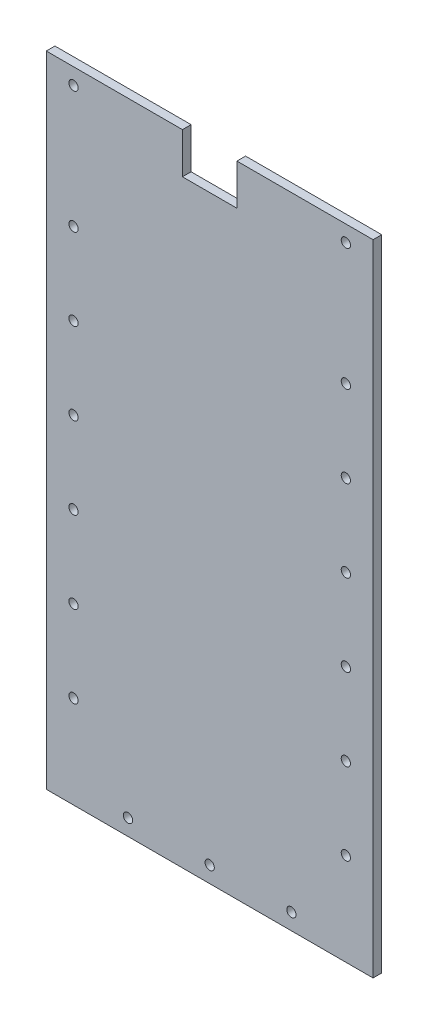
ISO-10303-21;
HEADER;
FILE_DESCRIPTION(('STEP AP214'),'2;1');
FILE_NAME('part.step','',(''),(''),'','','');
FILE_SCHEMA(('AUTOMOTIVE_DESIGN { 1 0 10303 214 1 1 1 1 }'));
ENDSEC;
DATA;
#1=APPLICATION_CONTEXT('core data for automotive mechanical design processes');
#2=APPLICATION_PROTOCOL_DEFINITION('international standard','automotive_design',2000,#1);
#3=PRODUCT_CONTEXT('',#1,'mechanical');
#4=PRODUCT('Part','Part','',(#3));
#5=PRODUCT_RELATED_PRODUCT_CATEGORY('part','',(#4));
#6=PRODUCT_DEFINITION_FORMATION('','',#4);
#7=PRODUCT_DEFINITION_CONTEXT('part definition',#1,'design');
#8=PRODUCT_DEFINITION('design','',#6,#7);
#9=PRODUCT_DEFINITION_SHAPE('','',#8);
#10=(LENGTH_UNIT() NAMED_UNIT(*) SI_UNIT(.MILLI.,.METRE.));
#11=(NAMED_UNIT(*) PLANE_ANGLE_UNIT() SI_UNIT($,.RADIAN.));
#12=(NAMED_UNIT(*) SI_UNIT($,.STERADIAN.) SOLID_ANGLE_UNIT());
#13=UNCERTAINTY_MEASURE_WITH_UNIT(LENGTH_MEASURE(1.E-05),#10,'distance_accuracy_value','');
#14=(GEOMETRIC_REPRESENTATION_CONTEXT(3) GLOBAL_UNCERTAINTY_ASSIGNED_CONTEXT((#13)) GLOBAL_UNIT_ASSIGNED_CONTEXT((#10,
#11,#12)) REPRESENTATION_CONTEXT('',''));
#15=CARTESIAN_POINT('',(0.,0.,0.));
#16=DIRECTION('',(0.,0.,1.));
#17=DIRECTION('',(1.,0.,0.));
#18=AXIS2_PLACEMENT_3D('',#15,#16,#17);
#19=CARTESIAN_POINT('',(0.,234.78,3.175));
#20=DIRECTION('',(0.,1.,0.));
#21=DIRECTION('',(0.,0.,1.));
#22=AXIS2_PLACEMENT_3D('',#19,#20,#21);
#23=PLANE('',#22);
#24=DIRECTION('',(0.,0.,1.));
#25=VECTOR('',#24,1.);
#26=CARTESIAN_POINT('',(70.,234.78,-0.00100000000000013));
#27=LINE('',#26,#25);
#28=CARTESIAN_POINT('',(70.,234.78,0.));
#29=VERTEX_POINT('',#28);
#30=CARTESIAN_POINT('',(70.,234.78,3.175));
#31=VERTEX_POINT('',#30);
#32=EDGE_CURVE('E110',#29,#31,#27,.T.);
#33=ORIENTED_EDGE('',*,*,#32,.T.);
#34=DIRECTION('',(1.,0.,0.));
#35=VECTOR('',#34,1.);
#36=CARTESIAN_POINT('',(0.,234.78,3.175));
#37=LINE('',#36,#35);
#38=CARTESIAN_POINT('',(120.,234.78,3.175));
#39=VERTEX_POINT('',#38);
#40=EDGE_CURVE('E264',#31,#39,#37,.T.);
#41=ORIENTED_EDGE('',*,*,#40,.T.);
#42=DIRECTION('',(0.,0.,-1.));
#43=VECTOR('',#42,1.);
#44=CARTESIAN_POINT('',(120.,234.78,3.175));
#45=LINE('',#44,#43);
#46=CARTESIAN_POINT('',(120.,234.78,0.));
#47=VERTEX_POINT('',#46);
#48=EDGE_CURVE('E43',#39,#47,#45,.T.);
#49=ORIENTED_EDGE('',*,*,#48,.T.);
#50=DIRECTION('',(1.,0.,0.));
#51=VECTOR('',#50,1.);
#52=CARTESIAN_POINT('',(0.,234.78,0.));
#53=LINE('',#52,#51);
#54=EDGE_CURVE('E124',#29,#47,#53,.T.);
#55=ORIENTED_EDGE('',*,*,#54,.F.);
#56=EDGE_LOOP('',(#33,#41,#49,#55));
#57=FACE_BOUND('',#56,.T.);
#58=ADVANCED_FACE('F34',(#57),#23,.T.);
#59=CARTESIAN_POINT('',(0.,0.,3.175));
#60=DIRECTION('',(0.,1.,0.));
#61=DIRECTION('',(0.,0.,1.));
#62=AXIS2_PLACEMENT_3D('',#59,#60,#61);
#63=PLANE('',#62);
#64=DIRECTION('',(1.,0.,0.));
#65=VECTOR('',#64,1.);
#66=CARTESIAN_POINT('',(0.,0.,0.));
#67=LINE('',#66,#65);
#68=CARTESIAN_POINT('',(0.,0.,0.));
#69=VERTEX_POINT('',#68);
#70=CARTESIAN_POINT('',(120.,0.,0.));
#71=VERTEX_POINT('',#70);
#72=EDGE_CURVE('E134',#69,#71,#67,.T.);
#73=ORIENTED_EDGE('',*,*,#72,.T.);
#74=DIRECTION('',(0.,0.,-1.));
#75=VECTOR('',#74,1.);
#76=CARTESIAN_POINT('',(120.,0.,3.175));
#77=LINE('',#76,#75);
#78=CARTESIAN_POINT('',(120.,0.,3.175));
#79=VERTEX_POINT('',#78);
#80=EDGE_CURVE('E11',#79,#71,#77,.T.);
#81=ORIENTED_EDGE('',*,*,#80,.F.);
#82=DIRECTION('',(1.,0.,0.));
#83=VECTOR('',#82,1.);
#84=CARTESIAN_POINT('',(0.,0.,3.175));
#85=LINE('',#84,#83);
#86=CARTESIAN_POINT('',(0.,0.,3.175));
#87=VERTEX_POINT('',#86);
#88=EDGE_CURVE('E140',#87,#79,#85,.T.);
#89=ORIENTED_EDGE('',*,*,#88,.F.);
#90=DIRECTION('',(0.,0.,-1.));
#91=VECTOR('',#90,1.);
#92=CARTESIAN_POINT('',(0.,0.,3.175));
#93=LINE('',#92,#91);
#94=EDGE_CURVE('E60',#87,#69,#93,.T.);
#95=ORIENTED_EDGE('',*,*,#94,.T.);
#96=EDGE_LOOP('',(#73,#81,#89,#95));
#97=FACE_BOUND('',#96,.T.);
#98=ADVANCED_FACE('F36',(#97),#63,.F.);
#99=CARTESIAN_POINT('',(120.,0.,3.175));
#100=DIRECTION('',(-1.,0.,0.));
#101=DIRECTION('',(0.,0.,1.));
#102=AXIS2_PLACEMENT_3D('',#99,#100,#101);
#103=PLANE('',#102);
#104=DIRECTION('',(0.,1.,0.));
#105=VECTOR('',#104,1.);
#106=CARTESIAN_POINT('',(120.,0.,0.));
#107=LINE('',#106,#105);
#108=EDGE_CURVE('E130',#71,#47,#107,.T.);
#109=ORIENTED_EDGE('',*,*,#108,.T.);
#110=ORIENTED_EDGE('',*,*,#48,.F.);
#111=DIRECTION('',(0.,1.,0.));
#112=VECTOR('',#111,1.);
#113=CARTESIAN_POINT('',(120.,0.,3.175));
#114=LINE('',#113,#112);
#115=EDGE_CURVE('E86',#79,#39,#114,.T.);
#116=ORIENTED_EDGE('',*,*,#115,.F.);
#117=ORIENTED_EDGE('',*,*,#80,.T.);
#118=EDGE_LOOP('',(#109,#110,#116,#117));
#119=FACE_BOUND('',#118,.T.);
#120=ADVANCED_FACE('F283',(#119),#103,.F.);
#121=DIRECTION('',(0.,0.,1.));
#122=VECTOR('',#121,1.);
#123=CARTESIAN_POINT('',(50.,234.78,-0.00100000000000013));
#124=LINE('',#123,#122);
#125=CARTESIAN_POINT('',(50.,234.78,0.));
#126=VERTEX_POINT('',#125);
#127=CARTESIAN_POINT('',(50.,234.78,3.175));
#128=VERTEX_POINT('',#127);
#129=EDGE_CURVE('E119',#126,#128,#124,.T.);
#130=ORIENTED_EDGE('',*,*,#129,.F.);
#131=CARTESIAN_POINT('',(0.,234.78,0.));
#132=VERTEX_POINT('',#131);
#133=EDGE_CURVE('E129',#132,#126,#53,.T.);
#134=ORIENTED_EDGE('',*,*,#133,.F.);
#135=DIRECTION('',(0.,0.,-1.));
#136=VECTOR('',#135,1.);
#137=CARTESIAN_POINT('',(0.,234.78,3.175));
#138=LINE('',#137,#136);
#139=CARTESIAN_POINT('',(0.,234.78,3.175));
#140=VERTEX_POINT('',#139);
#141=EDGE_CURVE('E142',#140,#132,#138,.T.);
#142=ORIENTED_EDGE('',*,*,#141,.F.);
#143=EDGE_CURVE('E265',#140,#128,#37,.T.);
#144=ORIENTED_EDGE('',*,*,#143,.T.);
#145=EDGE_LOOP('',(#130,#134,#142,#144));
#146=FACE_BOUND('',#145,.T.);
#147=ADVANCED_FACE('F275',(#146),#23,.T.);
#148=CARTESIAN_POINT('',(0.,0.,3.175));
#149=DIRECTION('',(-1.,0.,0.));
#150=DIRECTION('',(0.,0.,1.));
#151=AXIS2_PLACEMENT_3D('',#148,#149,#150);
#152=PLANE('',#151);
#153=DIRECTION('',(0.,1.,0.));
#154=VECTOR('',#153,1.);
#155=CARTESIAN_POINT('',(0.,0.,0.));
#156=LINE('',#155,#154);
#157=EDGE_CURVE('E133',#69,#132,#156,.T.);
#158=ORIENTED_EDGE('',*,*,#157,.F.);
#159=ORIENTED_EDGE('',*,*,#94,.F.);
#160=DIRECTION('',(0.,1.,0.));
#161=VECTOR('',#160,1.);
#162=CARTESIAN_POINT('',(0.,0.,3.175));
#163=LINE('',#162,#161);
#164=EDGE_CURVE('E143',#87,#140,#163,.T.);
#165=ORIENTED_EDGE('',*,*,#164,.T.);
#166=ORIENTED_EDGE('',*,*,#141,.T.);
#167=EDGE_LOOP('',(#158,#159,#165,#166));
#168=FACE_BOUND('',#167,.T.);
#169=ADVANCED_FACE('F269',(#168),#152,.T.);
#170=CARTESIAN_POINT('',(0.,0.,3.175));
#171=DIRECTION('',(0.,0.,1.));
#172=DIRECTION('',(1.,0.,0.));
#173=AXIS2_PLACEMENT_3D('',#170,#171,#172);
#174=PLANE('',#173);
#175=CARTESIAN_POINT('',(10.0000000000027,228.834897948557,3.17499999999999));
#176=DIRECTION('',(0.,0.,1.));
#177=DIRECTION('',(1.,0.,0.));
#178=AXIS2_PLACEMENT_3D('',#175,#176,#177);
#179=CIRCLE('',#178,1.7);
#180=CARTESIAN_POINT('',(11.7000000000027,228.834897948557,3.17499999999999));
#181=VERTEX_POINT('',#180);
#182=EDGE_CURVE('E200',#181,#181,#179,.T.);
#183=ORIENTED_EDGE('',*,*,#182,.F.);
#184=EDGE_LOOP('',(#183));
#185=FACE_BOUND('',#184,.T.);
#186=CARTESIAN_POINT('',(10.0000000000054,184.000000000001,3.17499999999999));
#187=DIRECTION('',(0.,0.,1.));
#188=DIRECTION('',(1.,0.,0.));
#189=AXIS2_PLACEMENT_3D('',#186,#187,#188);
#190=CIRCLE('',#189,1.7);
#191=CARTESIAN_POINT('',(11.7000000000054,184.000000000001,3.17499999999999));
#192=VERTEX_POINT('',#191);
#193=EDGE_CURVE('E189',#192,#192,#190,.T.);
#194=ORIENTED_EDGE('',*,*,#193,.F.);
#195=EDGE_LOOP('',(#194));
#196=FACE_BOUND('',#195,.T.);
#197=CARTESIAN_POINT('',(10.0000000000052,124.000000000001,3.17499999999999));
#198=DIRECTION('',(0.,0.,1.));
#199=DIRECTION('',(1.,0.,0.));
#200=AXIS2_PLACEMENT_3D('',#197,#198,#199);
#201=CIRCLE('',#200,1.7);
#202=CARTESIAN_POINT('',(11.7000000000052,124.000000000001,3.17499999999999));
#203=VERTEX_POINT('',#202);
#204=EDGE_CURVE('E188',#203,#203,#201,.T.);
#205=ORIENTED_EDGE('',*,*,#204,.F.);
#206=EDGE_LOOP('',(#205));
#207=FACE_BOUND('',#206,.T.);
#208=CARTESIAN_POINT('',(10.0000000000051,94.0000000000007,3.17499999999999));
#209=DIRECTION('',(0.,0.,1.));
#210=DIRECTION('',(1.,0.,0.));
#211=AXIS2_PLACEMENT_3D('',#208,#209,#210);
#212=CIRCLE('',#211,1.7);
#213=CARTESIAN_POINT('',(11.7000000000051,94.0000000000007,3.17499999999999));
#214=VERTEX_POINT('',#213);
#215=EDGE_CURVE('E185',#214,#214,#212,.T.);
#216=ORIENTED_EDGE('',*,*,#215,.F.);
#217=EDGE_LOOP('',(#216));
#218=FACE_BOUND('',#217,.T.);
#219=CARTESIAN_POINT('',(10.0000000000049,64.0000000000007,3.17499999999999));
#220=DIRECTION('',(0.,0.,1.));
#221=DIRECTION('',(1.,0.,0.));
#222=AXIS2_PLACEMENT_3D('',#219,#220,#221);
#223=CIRCLE('',#222,1.7);
#224=CARTESIAN_POINT('',(11.7000000000049,64.0000000000007,3.17499999999999));
#225=VERTEX_POINT('',#224);
#226=EDGE_CURVE('E182',#225,#225,#223,.T.);
#227=ORIENTED_EDGE('',*,*,#226,.F.);
#228=EDGE_LOOP('',(#227));
#229=FACE_BOUND('',#228,.T.);
#230=CARTESIAN_POINT('',(10.0000000000048,34.0000000000007,3.17499999999999));
#231=DIRECTION('',(0.,0.,1.));
#232=DIRECTION('',(1.,0.,0.));
#233=AXIS2_PLACEMENT_3D('',#230,#231,#232);
#234=CIRCLE('',#233,1.7);
#235=CARTESIAN_POINT('',(11.7000000000048,34.0000000000007,3.17499999999999));
#236=VERTEX_POINT('',#235);
#237=EDGE_CURVE('E178',#236,#236,#234,.T.);
#238=ORIENTED_EDGE('',*,*,#237,.F.);
#239=EDGE_LOOP('',(#238));
#240=FACE_BOUND('',#239,.T.);
#241=CARTESIAN_POINT('',(110.000000000003,228.834897948556,3.17499999999999));
#242=DIRECTION('',(0.,0.,1.));
#243=DIRECTION('',(1.,0.,0.));
#244=AXIS2_PLACEMENT_3D('',#241,#242,#243);
#245=CIRCLE('',#244,1.69999999999999);
#246=CARTESIAN_POINT('',(111.700000000003,228.834897948556,3.17499999999999));
#247=VERTEX_POINT('',#246);
#248=EDGE_CURVE('E177',#247,#247,#245,.T.);
#249=ORIENTED_EDGE('',*,*,#248,.F.);
#250=EDGE_LOOP('',(#249));
#251=FACE_BOUND('',#250,.T.);
#252=CARTESIAN_POINT('',(10.0000000000053,154.000000000001,3.17499999999999));
#253=DIRECTION('',(0.,0.,1.));
#254=DIRECTION('',(1.,0.,0.));
#255=AXIS2_PLACEMENT_3D('',#252,#253,#254);
#256=CIRCLE('',#255,1.7);
#257=CARTESIAN_POINT('',(11.7000000000053,154.000000000001,3.17499999999999));
#258=VERTEX_POINT('',#257);
#259=EDGE_CURVE('E173',#258,#258,#256,.T.);
#260=ORIENTED_EDGE('',*,*,#259,.F.);
#261=EDGE_LOOP('',(#260));
#262=FACE_BOUND('',#261,.T.);
#263=CARTESIAN_POINT('',(29.9999999999996,5.94489794855652,3.17499999999999));
#264=DIRECTION('',(0.,0.,1.));
#265=DIRECTION('',(1.,0.,0.));
#266=AXIS2_PLACEMENT_3D('',#263,#264,#265);
#267=CIRCLE('',#266,1.7);
#268=CARTESIAN_POINT('',(31.6999999999996,5.94489794855652,3.17499999999999));
#269=VERTEX_POINT('',#268);
#270=EDGE_CURVE('E172',#269,#269,#267,.T.);
#271=ORIENTED_EDGE('',*,*,#270,.F.);
#272=EDGE_LOOP('',(#271));
#273=FACE_BOUND('',#272,.T.);
#274=CARTESIAN_POINT('',(59.9999999999996,5.9448979485561,3.17499999999999));
#275=DIRECTION('',(0.,0.,1.));
#276=DIRECTION('',(1.,0.,0.));
#277=AXIS2_PLACEMENT_3D('',#274,#275,#276);
#278=CIRCLE('',#277,1.7);
#279=CARTESIAN_POINT('',(61.6999999999996,5.9448979485561,3.17499999999999));
#280=VERTEX_POINT('',#279);
#281=EDGE_CURVE('E223',#280,#280,#278,.T.);
#282=ORIENTED_EDGE('',*,*,#281,.F.);
#283=EDGE_LOOP('',(#282));
#284=FACE_BOUND('',#283,.T.);
#285=CARTESIAN_POINT('',(89.9999999999996,5.94489794855568,3.17499999999999));
#286=DIRECTION('',(0.,0.,1.));
#287=DIRECTION('',(1.,0.,0.));
#288=AXIS2_PLACEMENT_3D('',#285,#286,#287);
#289=CIRCLE('',#288,1.69999999999999);
#290=CARTESIAN_POINT('',(91.6999999999996,5.94489794855568,3.17499999999999));
#291=VERTEX_POINT('',#290);
#292=EDGE_CURVE('E168',#291,#291,#289,.T.);
#293=ORIENTED_EDGE('',*,*,#292,.F.);
#294=EDGE_LOOP('',(#293));
#295=FACE_BOUND('',#294,.T.);
#296=CARTESIAN_POINT('',(110.000000000003,184.000000000001,3.17499999999999));
#297=DIRECTION('',(0.,0.,1.));
#298=DIRECTION('',(1.,0.,0.));
#299=AXIS2_PLACEMENT_3D('',#296,#297,#298);
#300=CIRCLE('',#299,1.69999999999999);
#301=CARTESIAN_POINT('',(111.700000000003,184.000000000001,3.17499999999999));
#302=VERTEX_POINT('',#301);
#303=EDGE_CURVE('E167',#302,#302,#300,.T.);
#304=ORIENTED_EDGE('',*,*,#303,.F.);
#305=EDGE_LOOP('',(#304));
#306=FACE_BOUND('',#305,.T.);
#307=CARTESIAN_POINT('',(110.000000000003,154.000000000001,3.17499999999999));
#308=DIRECTION('',(0.,0.,1.));
#309=DIRECTION('',(1.,0.,0.));
#310=AXIS2_PLACEMENT_3D('',#307,#308,#309);
#311=CIRCLE('',#310,1.69999999999999);
#312=CARTESIAN_POINT('',(111.700000000003,154.000000000001,3.17499999999999));
#313=VERTEX_POINT('',#312);
#314=EDGE_CURVE('E163',#313,#313,#311,.T.);
#315=ORIENTED_EDGE('',*,*,#314,.F.);
#316=EDGE_LOOP('',(#315));
#317=FACE_BOUND('',#316,.T.);
#318=CARTESIAN_POINT('',(110.000000000003,124.000000000001,3.17499999999999));
#319=DIRECTION('',(0.,0.,1.));
#320=DIRECTION('',(1.,0.,0.));
#321=AXIS2_PLACEMENT_3D('',#318,#319,#320);
#322=CIRCLE('',#321,1.69999999999999);
#323=CARTESIAN_POINT('',(111.700000000003,124.000000000001,3.17499999999999));
#324=VERTEX_POINT('',#323);
#325=EDGE_CURVE('E159',#324,#324,#322,.T.);
#326=ORIENTED_EDGE('',*,*,#325,.F.);
#327=EDGE_LOOP('',(#326));
#328=FACE_BOUND('',#327,.T.);
#329=CARTESIAN_POINT('',(110.000000000003,94.0000000000007,3.17499999999999));
#330=DIRECTION('',(0.,0.,1.));
#331=DIRECTION('',(1.,0.,0.));
#332=AXIS2_PLACEMENT_3D('',#329,#330,#331);
#333=CIRCLE('',#332,1.69999999999999);
#334=CARTESIAN_POINT('',(111.700000000003,94.0000000000007,3.17499999999999));
#335=VERTEX_POINT('',#334);
#336=EDGE_CURVE('E155',#335,#335,#333,.T.);
#337=ORIENTED_EDGE('',*,*,#336,.F.);
#338=EDGE_LOOP('',(#337));
#339=FACE_BOUND('',#338,.T.);
#340=CARTESIAN_POINT('',(110.000000000003,64.0000000000007,3.17499999999999));
#341=DIRECTION('',(0.,0.,1.));
#342=DIRECTION('',(1.,0.,0.));
#343=AXIS2_PLACEMENT_3D('',#340,#341,#342);
#344=CIRCLE('',#343,1.69999999999999);
#345=CARTESIAN_POINT('',(111.700000000003,64.0000000000007,3.17499999999999));
#346=VERTEX_POINT('',#345);
#347=EDGE_CURVE('E154',#346,#346,#344,.T.);
#348=ORIENTED_EDGE('',*,*,#347,.F.);
#349=EDGE_LOOP('',(#348));
#350=FACE_BOUND('',#349,.T.);
#351=CARTESIAN_POINT('',(110.000000000003,34.0000000000007,3.17499999999999));
#352=DIRECTION('',(0.,0.,1.));
#353=DIRECTION('',(1.,0.,0.));
#354=AXIS2_PLACEMENT_3D('',#351,#352,#353);
#355=CIRCLE('',#354,1.69999999999999);
#356=CARTESIAN_POINT('',(111.700000000003,34.0000000000007,3.17499999999999));
#357=VERTEX_POINT('',#356);
#358=EDGE_CURVE('E150',#357,#357,#355,.T.);
#359=ORIENTED_EDGE('',*,*,#358,.F.);
#360=EDGE_LOOP('',(#359));
#361=FACE_BOUND('',#360,.T.);
#362=DIRECTION('',(0.,1.,0.));
#363=VECTOR('',#362,1.);
#364=CARTESIAN_POINT('',(70.,219.78,3.175));
#365=LINE('',#364,#363);
#366=CARTESIAN_POINT('',(70.,219.78,3.175));
#367=VERTEX_POINT('',#366);
#368=EDGE_CURVE('E115',#367,#31,#365,.T.);
#369=ORIENTED_EDGE('',*,*,#368,.F.);
#370=DIRECTION('',(1.,0.,0.));
#371=VECTOR('',#370,1.);
#372=CARTESIAN_POINT('',(50.,219.78,3.175));
#373=LINE('',#372,#371);
#374=CARTESIAN_POINT('',(50.,219.78,3.175));
#375=VERTEX_POINT('',#374);
#376=EDGE_CURVE('E120',#375,#367,#373,.T.);
#377=ORIENTED_EDGE('',*,*,#376,.F.);
#378=DIRECTION('',(0.,-1.,0.));
#379=VECTOR('',#378,1.);
#380=CARTESIAN_POINT('',(50.,219.78,3.175));
#381=LINE('',#380,#379);
#382=EDGE_CURVE('E252',#128,#375,#381,.T.);
#383=ORIENTED_EDGE('',*,*,#382,.F.);
#384=ORIENTED_EDGE('',*,*,#143,.F.);
#385=ORIENTED_EDGE('',*,*,#164,.F.);
#386=ORIENTED_EDGE('',*,*,#88,.T.);
#387=ORIENTED_EDGE('',*,*,#115,.T.);
#388=ORIENTED_EDGE('',*,*,#40,.F.);
#389=EDGE_LOOP('',(#369,#377,#383,#384,#385,#386,#387,#388));
#390=FACE_BOUND('',#389,.T.);
#391=ADVANCED_FACE('F282',(#185,#196,#207,#218,#229,#240,#251,#262,#273,#284,#295,#306,#317,
#328,#339,#350,#361,#390),#174,.T.);
#392=CARTESIAN_POINT('',(0.,0.,0.));
#393=DIRECTION('',(0.,0.,1.));
#394=DIRECTION('',(1.,0.,0.));
#395=AXIS2_PLACEMENT_3D('',#392,#393,#394);
#396=PLANE('',#395);
#397=CARTESIAN_POINT('',(10.0000000000027,228.834897948557,0.));
#398=DIRECTION('',(0.,0.,1.));
#399=DIRECTION('',(1.,0.,0.));
#400=AXIS2_PLACEMENT_3D('',#397,#398,#399);
#401=CIRCLE('',#400,1.7);
#402=CARTESIAN_POINT('',(11.7000000000027,228.834897948557,0.));
#403=VERTEX_POINT('',#402);
#404=EDGE_CURVE('E38',#403,#403,#401,.T.);
#405=ORIENTED_EDGE('',*,*,#404,.T.);
#406=EDGE_LOOP('',(#405));
#407=FACE_BOUND('',#406,.T.);
#408=CARTESIAN_POINT('',(10.0000000000054,184.000000000001,0.));
#409=DIRECTION('',(0.,0.,1.));
#410=DIRECTION('',(1.,0.,0.));
#411=AXIS2_PLACEMENT_3D('',#408,#409,#410);
#412=CIRCLE('',#411,1.7);
#413=CARTESIAN_POINT('',(11.7000000000054,184.000000000001,0.));
#414=VERTEX_POINT('',#413);
#415=EDGE_CURVE('E186',#414,#414,#412,.T.);
#416=ORIENTED_EDGE('',*,*,#415,.T.);
#417=EDGE_LOOP('',(#416));
#418=FACE_BOUND('',#417,.T.);
#419=CARTESIAN_POINT('',(10.0000000000052,124.000000000001,0.));
#420=DIRECTION('',(0.,0.,1.));
#421=DIRECTION('',(1.,0.,0.));
#422=AXIS2_PLACEMENT_3D('',#419,#420,#421);
#423=CIRCLE('',#422,1.7);
#424=CARTESIAN_POINT('',(11.7000000000052,124.000000000001,0.));
#425=VERTEX_POINT('',#424);
#426=EDGE_CURVE('E193',#425,#425,#423,.T.);
#427=ORIENTED_EDGE('',*,*,#426,.T.);
#428=EDGE_LOOP('',(#427));
#429=FACE_BOUND('',#428,.T.);
#430=CARTESIAN_POINT('',(10.0000000000051,94.0000000000007,0.));
#431=DIRECTION('',(0.,0.,1.));
#432=DIRECTION('',(1.,0.,0.));
#433=AXIS2_PLACEMENT_3D('',#430,#431,#432);
#434=CIRCLE('',#433,1.7);
#435=CARTESIAN_POINT('',(11.7000000000051,94.0000000000007,0.));
#436=VERTEX_POINT('',#435);
#437=EDGE_CURVE('E183',#436,#436,#434,.T.);
#438=ORIENTED_EDGE('',*,*,#437,.T.);
#439=EDGE_LOOP('',(#438));
#440=FACE_BOUND('',#439,.T.);
#441=CARTESIAN_POINT('',(10.0000000000049,64.0000000000007,0.));
#442=DIRECTION('',(0.,0.,1.));
#443=DIRECTION('',(1.,0.,0.));
#444=AXIS2_PLACEMENT_3D('',#441,#442,#443);
#445=CIRCLE('',#444,1.7);
#446=CARTESIAN_POINT('',(11.7000000000049,64.0000000000007,0.));
#447=VERTEX_POINT('',#446);
#448=EDGE_CURVE('E179',#447,#447,#445,.T.);
#449=ORIENTED_EDGE('',*,*,#448,.T.);
#450=EDGE_LOOP('',(#449));
#451=FACE_BOUND('',#450,.T.);
#452=CARTESIAN_POINT('',(10.0000000000048,34.0000000000007,0.));
#453=DIRECTION('',(0.,0.,1.));
#454=DIRECTION('',(1.,0.,0.));
#455=AXIS2_PLACEMENT_3D('',#452,#453,#454);
#456=CIRCLE('',#455,1.7);
#457=CARTESIAN_POINT('',(11.7000000000048,34.0000000000007,0.));
#458=VERTEX_POINT('',#457);
#459=EDGE_CURVE('E174',#458,#458,#456,.T.);
#460=ORIENTED_EDGE('',*,*,#459,.T.);
#461=EDGE_LOOP('',(#460));
#462=FACE_BOUND('',#461,.T.);
#463=CARTESIAN_POINT('',(110.000000000003,228.834897948556,0.));
#464=DIRECTION('',(0.,0.,1.));
#465=DIRECTION('',(1.,0.,0.));
#466=AXIS2_PLACEMENT_3D('',#463,#464,#465);
#467=CIRCLE('',#466,1.69999999999999);
#468=CARTESIAN_POINT('',(111.700000000003,228.834897948556,0.));
#469=VERTEX_POINT('',#468);
#470=EDGE_CURVE('E213',#469,#469,#467,.T.);
#471=ORIENTED_EDGE('',*,*,#470,.T.);
#472=EDGE_LOOP('',(#471));
#473=FACE_BOUND('',#472,.T.);
#474=CARTESIAN_POINT('',(10.0000000000053,154.000000000001,0.));
#475=DIRECTION('',(0.,0.,1.));
#476=DIRECTION('',(1.,0.,0.));
#477=AXIS2_PLACEMENT_3D('',#474,#475,#476);
#478=CIRCLE('',#477,1.7);
#479=CARTESIAN_POINT('',(11.7000000000053,154.000000000001,0.));
#480=VERTEX_POINT('',#479);
#481=EDGE_CURVE('E169',#480,#480,#478,.T.);
#482=ORIENTED_EDGE('',*,*,#481,.T.);
#483=EDGE_LOOP('',(#482));
#484=FACE_BOUND('',#483,.T.);
#485=CARTESIAN_POINT('',(29.9999999999996,5.94489794855652,0.));
#486=DIRECTION('',(0.,0.,1.));
#487=DIRECTION('',(1.,0.,0.));
#488=AXIS2_PLACEMENT_3D('',#485,#486,#487);
#489=CIRCLE('',#488,1.7);
#490=CARTESIAN_POINT('',(31.6999999999996,5.94489794855652,0.));
#491=VERTEX_POINT('',#490);
#492=EDGE_CURVE('E220',#491,#491,#489,.T.);
#493=ORIENTED_EDGE('',*,*,#492,.T.);
#494=EDGE_LOOP('',(#493));
#495=FACE_BOUND('',#494,.T.);
#496=CARTESIAN_POINT('',(59.9999999999996,5.9448979485561,0.));
#497=DIRECTION('',(0.,0.,1.));
#498=DIRECTION('',(1.,0.,0.));
#499=AXIS2_PLACEMENT_3D('',#496,#497,#498);
#500=CIRCLE('',#499,1.7);
#501=CARTESIAN_POINT('',(61.6999999999996,5.9448979485561,0.));
#502=VERTEX_POINT('',#501);
#503=EDGE_CURVE('E226',#502,#502,#500,.T.);
#504=ORIENTED_EDGE('',*,*,#503,.T.);
#505=EDGE_LOOP('',(#504));
#506=FACE_BOUND('',#505,.T.);
#507=CARTESIAN_POINT('',(89.9999999999996,5.94489794855568,0.));
#508=DIRECTION('',(0.,0.,1.));
#509=DIRECTION('',(1.,0.,0.));
#510=AXIS2_PLACEMENT_3D('',#507,#508,#509);
#511=CIRCLE('',#510,1.69999999999999);
#512=CARTESIAN_POINT('',(91.6999999999996,5.94489794855568,0.));
#513=VERTEX_POINT('',#512);
#514=EDGE_CURVE('E164',#513,#513,#511,.T.);
#515=ORIENTED_EDGE('',*,*,#514,.T.);
#516=EDGE_LOOP('',(#515));
#517=FACE_BOUND('',#516,.T.);
#518=CARTESIAN_POINT('',(110.000000000003,184.000000000001,0.));
#519=DIRECTION('',(0.,0.,1.));
#520=DIRECTION('',(1.,0.,0.));
#521=AXIS2_PLACEMENT_3D('',#518,#519,#520);
#522=CIRCLE('',#521,1.69999999999999);
#523=CARTESIAN_POINT('',(111.700000000003,184.000000000001,0.));
#524=VERTEX_POINT('',#523);
#525=EDGE_CURVE('E233',#524,#524,#522,.T.);
#526=ORIENTED_EDGE('',*,*,#525,.T.);
#527=EDGE_LOOP('',(#526));
#528=FACE_BOUND('',#527,.T.);
#529=CARTESIAN_POINT('',(110.000000000003,154.000000000001,0.));
#530=DIRECTION('',(0.,0.,1.));
#531=DIRECTION('',(1.,0.,0.));
#532=AXIS2_PLACEMENT_3D('',#529,#530,#531);
#533=CIRCLE('',#532,1.69999999999999);
#534=CARTESIAN_POINT('',(111.700000000003,154.000000000001,0.));
#535=VERTEX_POINT('',#534);
#536=EDGE_CURVE('E160',#535,#535,#533,.T.);
#537=ORIENTED_EDGE('',*,*,#536,.T.);
#538=EDGE_LOOP('',(#537));
#539=FACE_BOUND('',#538,.T.);
#540=CARTESIAN_POINT('',(110.000000000003,124.000000000001,0.));
#541=DIRECTION('',(0.,0.,1.));
#542=DIRECTION('',(1.,0.,0.));
#543=AXIS2_PLACEMENT_3D('',#540,#541,#542);
#544=CIRCLE('',#543,1.69999999999999);
#545=CARTESIAN_POINT('',(111.700000000003,124.000000000001,0.));
#546=VERTEX_POINT('',#545);
#547=EDGE_CURVE('E156',#546,#546,#544,.T.);
#548=ORIENTED_EDGE('',*,*,#547,.T.);
#549=EDGE_LOOP('',(#548));
#550=FACE_BOUND('',#549,.T.);
#551=CARTESIAN_POINT('',(110.000000000003,94.0000000000007,0.));
#552=DIRECTION('',(0.,0.,1.));
#553=DIRECTION('',(1.,0.,0.));
#554=AXIS2_PLACEMENT_3D('',#551,#552,#553);
#555=CIRCLE('',#554,1.69999999999999);
#556=CARTESIAN_POINT('',(111.700000000003,94.0000000000007,0.));
#557=VERTEX_POINT('',#556);
#558=EDGE_CURVE('E151',#557,#557,#555,.T.);
#559=ORIENTED_EDGE('',*,*,#558,.T.);
#560=EDGE_LOOP('',(#559));
#561=FACE_BOUND('',#560,.T.);
#562=CARTESIAN_POINT('',(110.000000000003,64.0000000000007,0.));
#563=DIRECTION('',(0.,0.,1.));
#564=DIRECTION('',(1.,0.,0.));
#565=AXIS2_PLACEMENT_3D('',#562,#563,#564);
#566=CIRCLE('',#565,1.69999999999999);
#567=CARTESIAN_POINT('',(111.700000000003,64.0000000000007,0.));
#568=VERTEX_POINT('',#567);
#569=EDGE_CURVE('E244',#568,#568,#566,.T.);
#570=ORIENTED_EDGE('',*,*,#569,.T.);
#571=EDGE_LOOP('',(#570));
#572=FACE_BOUND('',#571,.T.);
#573=CARTESIAN_POINT('',(110.000000000003,34.0000000000007,0.));
#574=DIRECTION('',(0.,0.,1.));
#575=DIRECTION('',(1.,0.,0.));
#576=AXIS2_PLACEMENT_3D('',#573,#574,#575);
#577=CIRCLE('',#576,1.69999999999999);
#578=CARTESIAN_POINT('',(111.700000000003,34.0000000000007,0.));
#579=VERTEX_POINT('',#578);
#580=EDGE_CURVE('E146',#579,#579,#577,.T.);
#581=ORIENTED_EDGE('',*,*,#580,.T.);
#582=EDGE_LOOP('',(#581));
#583=FACE_BOUND('',#582,.T.);
#584=DIRECTION('',(-1.,0.,0.));
#585=VECTOR('',#584,1.);
#586=CARTESIAN_POINT('',(50.,219.78,0.));
#587=LINE('',#586,#585);
#588=CARTESIAN_POINT('',(70.,219.78,0.));
#589=VERTEX_POINT('',#588);
#590=CARTESIAN_POINT('',(50.,219.78,0.));
#591=VERTEX_POINT('',#590);
#592=EDGE_CURVE('E51',#589,#591,#587,.T.);
#593=ORIENTED_EDGE('',*,*,#592,.F.);
#594=DIRECTION('',(0.,-1.,0.));
#595=VECTOR('',#594,1.);
#596=CARTESIAN_POINT('',(70.,219.78,0.));
#597=LINE('',#596,#595);
#598=EDGE_CURVE('E113',#29,#589,#597,.T.);
#599=ORIENTED_EDGE('',*,*,#598,.F.);
#600=ORIENTED_EDGE('',*,*,#54,.T.);
#601=ORIENTED_EDGE('',*,*,#108,.F.);
#602=ORIENTED_EDGE('',*,*,#72,.F.);
#603=ORIENTED_EDGE('',*,*,#157,.T.);
#604=ORIENTED_EDGE('',*,*,#133,.T.);
#605=DIRECTION('',(0.,1.,0.));
#606=VECTOR('',#605,1.);
#607=CARTESIAN_POINT('',(50.,219.78,0.));
#608=LINE('',#607,#606);
#609=EDGE_CURVE('E149',#591,#126,#608,.T.);
#610=ORIENTED_EDGE('',*,*,#609,.F.);
#611=EDGE_LOOP('',(#593,#599,#600,#601,#602,#603,#604,#610));
#612=FACE_BOUND('',#611,.T.);
#613=ADVANCED_FACE('F123',(#407,#418,#429,#440,#451,#462,#473,#484,#495,#506,#517,#528,#539,
#550,#561,#572,#583,#612),#396,.F.);
#614=CARTESIAN_POINT('',(70.,219.78,-0.00100000000000013));
#615=DIRECTION('',(1.,0.,0.));
#616=DIRECTION('',(0.,0.,-1.));
#617=AXIS2_PLACEMENT_3D('',#614,#615,#616);
#618=PLANE('',#617);
#619=ORIENTED_EDGE('',*,*,#598,.T.);
#620=DIRECTION('',(0.,0.,1.));
#621=VECTOR('',#620,1.);
#622=CARTESIAN_POINT('',(70.,219.78,-0.00100000000000013));
#623=LINE('',#622,#621);
#624=EDGE_CURVE('E257',#589,#367,#623,.T.);
#625=ORIENTED_EDGE('',*,*,#624,.T.);
#626=ORIENTED_EDGE('',*,*,#368,.T.);
#627=ORIENTED_EDGE('',*,*,#32,.F.);
#628=EDGE_LOOP('',(#619,#625,#626,#627));
#629=FACE_BOUND('',#628,.T.);
#630=ADVANCED_FACE('F112',(#629),#618,.F.);
#631=CARTESIAN_POINT('',(50.,219.78,-0.00100000000000013));
#632=DIRECTION('',(0.,-1.,0.));
#633=DIRECTION('',(0.,0.,-1.));
#634=AXIS2_PLACEMENT_3D('',#631,#632,#633);
#635=PLANE('',#634);
#636=ORIENTED_EDGE('',*,*,#592,.T.);
#637=DIRECTION('',(0.,0.,1.));
#638=VECTOR('',#637,1.);
#639=CARTESIAN_POINT('',(50.,219.78,-0.00100000000000013));
#640=LINE('',#639,#638);
#641=EDGE_CURVE('E259',#591,#375,#640,.T.);
#642=ORIENTED_EDGE('',*,*,#641,.T.);
#643=ORIENTED_EDGE('',*,*,#376,.T.);
#644=ORIENTED_EDGE('',*,*,#624,.F.);
#645=EDGE_LOOP('',(#636,#642,#643,#644));
#646=FACE_BOUND('',#645,.T.);
#647=ADVANCED_FACE('F280',(#646),#635,.F.);
#648=CARTESIAN_POINT('',(50.,219.78,-0.00100000000000013));
#649=DIRECTION('',(-1.,0.,0.));
#650=DIRECTION('',(0.,0.,1.));
#651=AXIS2_PLACEMENT_3D('',#648,#649,#650);
#652=PLANE('',#651);
#653=ORIENTED_EDGE('',*,*,#609,.T.);
#654=ORIENTED_EDGE('',*,*,#129,.T.);
#655=ORIENTED_EDGE('',*,*,#382,.T.);
#656=ORIENTED_EDGE('',*,*,#641,.F.);
#657=EDGE_LOOP('',(#653,#654,#655,#656));
#658=FACE_BOUND('',#657,.T.);
#659=ADVANCED_FACE('F277',(#658),#652,.F.);
#660=CARTESIAN_POINT('',(110.000000000003,34.0000000000007,3.17499999999999));
#661=DIRECTION('',(0.,0.,1.));
#662=DIRECTION('',(1.,0.,0.));
#663=AXIS2_PLACEMENT_3D('',#660,#661,#662);
#664=CYLINDRICAL_SURFACE('',#663,1.69999999999999);
#665=ORIENTED_EDGE('',*,*,#358,.T.);
#666=EDGE_LOOP('',(#665));
#667=FACE_BOUND('',#666,.T.);
#668=ORIENTED_EDGE('',*,*,#580,.F.);
#669=EDGE_LOOP('',(#668));
#670=FACE_BOUND('',#669,.T.);
#671=ADVANCED_FACE('F306',(#667,#670),#664,.F.);
#672=CARTESIAN_POINT('',(110.000000000003,64.0000000000007,3.17499999999999));
#673=DIRECTION('',(0.,0.,1.));
#674=DIRECTION('',(1.,0.,0.));
#675=AXIS2_PLACEMENT_3D('',#672,#673,#674);
#676=CYLINDRICAL_SURFACE('',#675,1.69999999999999);
#677=ORIENTED_EDGE('',*,*,#347,.T.);
#678=EDGE_LOOP('',(#677));
#679=FACE_BOUND('',#678,.T.);
#680=ORIENTED_EDGE('',*,*,#569,.F.);
#681=EDGE_LOOP('',(#680));
#682=FACE_BOUND('',#681,.T.);
#683=ADVANCED_FACE('F311',(#679,#682),#676,.F.);
#684=CARTESIAN_POINT('',(110.000000000003,94.0000000000007,3.17499999999999));
#685=DIRECTION('',(0.,0.,1.));
#686=DIRECTION('',(1.,0.,0.));
#687=AXIS2_PLACEMENT_3D('',#684,#685,#686);
#688=CYLINDRICAL_SURFACE('',#687,1.69999999999999);
#689=ORIENTED_EDGE('',*,*,#336,.T.);
#690=EDGE_LOOP('',(#689));
#691=FACE_BOUND('',#690,.T.);
#692=ORIENTED_EDGE('',*,*,#558,.F.);
#693=EDGE_LOOP('',(#692));
#694=FACE_BOUND('',#693,.T.);
#695=ADVANCED_FACE('F315',(#691,#694),#688,.F.);
#696=CARTESIAN_POINT('',(110.000000000003,124.000000000001,3.17499999999999));
#697=DIRECTION('',(0.,0.,1.));
#698=DIRECTION('',(1.,0.,0.));
#699=AXIS2_PLACEMENT_3D('',#696,#697,#698);
#700=CYLINDRICAL_SURFACE('',#699,1.69999999999999);
#701=ORIENTED_EDGE('',*,*,#325,.T.);
#702=EDGE_LOOP('',(#701));
#703=FACE_BOUND('',#702,.T.);
#704=ORIENTED_EDGE('',*,*,#547,.F.);
#705=EDGE_LOOP('',(#704));
#706=FACE_BOUND('',#705,.T.);
#707=ADVANCED_FACE('F319',(#703,#706),#700,.F.);
#708=CARTESIAN_POINT('',(110.000000000003,154.000000000001,3.17499999999999));
#709=DIRECTION('',(0.,0.,1.));
#710=DIRECTION('',(1.,0.,0.));
#711=AXIS2_PLACEMENT_3D('',#708,#709,#710);
#712=CYLINDRICAL_SURFACE('',#711,1.69999999999999);
#713=ORIENTED_EDGE('',*,*,#314,.T.);
#714=EDGE_LOOP('',(#713));
#715=FACE_BOUND('',#714,.T.);
#716=ORIENTED_EDGE('',*,*,#536,.F.);
#717=EDGE_LOOP('',(#716));
#718=FACE_BOUND('',#717,.T.);
#719=ADVANCED_FACE('F323',(#715,#718),#712,.F.);
#720=CARTESIAN_POINT('',(110.000000000003,184.000000000001,3.17499999999999));
#721=DIRECTION('',(0.,0.,1.));
#722=DIRECTION('',(1.,0.,0.));
#723=AXIS2_PLACEMENT_3D('',#720,#721,#722);
#724=CYLINDRICAL_SURFACE('',#723,1.69999999999999);
#725=ORIENTED_EDGE('',*,*,#303,.T.);
#726=EDGE_LOOP('',(#725));
#727=FACE_BOUND('',#726,.T.);
#728=ORIENTED_EDGE('',*,*,#525,.F.);
#729=EDGE_LOOP('',(#728));
#730=FACE_BOUND('',#729,.T.);
#731=ADVANCED_FACE('F327',(#727,#730),#724,.F.);
#732=CARTESIAN_POINT('',(89.9999999999996,5.94489794855568,3.17499999999999));
#733=DIRECTION('',(0.,0.,1.));
#734=DIRECTION('',(1.,0.,0.));
#735=AXIS2_PLACEMENT_3D('',#732,#733,#734);
#736=CYLINDRICAL_SURFACE('',#735,1.69999999999999);
#737=ORIENTED_EDGE('',*,*,#292,.T.);
#738=EDGE_LOOP('',(#737));
#739=FACE_BOUND('',#738,.T.);
#740=ORIENTED_EDGE('',*,*,#514,.F.);
#741=EDGE_LOOP('',(#740));
#742=FACE_BOUND('',#741,.T.);
#743=ADVANCED_FACE('F331',(#739,#742),#736,.F.);
#744=CARTESIAN_POINT('',(59.9999999999996,5.9448979485561,3.17499999999999));
#745=DIRECTION('',(0.,0.,1.));
#746=DIRECTION('',(1.,0.,0.));
#747=AXIS2_PLACEMENT_3D('',#744,#745,#746);
#748=CYLINDRICAL_SURFACE('',#747,1.7);
#749=ORIENTED_EDGE('',*,*,#281,.T.);
#750=EDGE_LOOP('',(#749));
#751=FACE_BOUND('',#750,.T.);
#752=ORIENTED_EDGE('',*,*,#503,.F.);
#753=EDGE_LOOP('',(#752));
#754=FACE_BOUND('',#753,.T.);
#755=ADVANCED_FACE('F335',(#751,#754),#748,.F.);
#756=CARTESIAN_POINT('',(29.9999999999996,5.94489794855652,3.17499999999999));
#757=DIRECTION('',(0.,0.,1.));
#758=DIRECTION('',(1.,0.,0.));
#759=AXIS2_PLACEMENT_3D('',#756,#757,#758);
#760=CYLINDRICAL_SURFACE('',#759,1.7);
#761=ORIENTED_EDGE('',*,*,#270,.T.);
#762=EDGE_LOOP('',(#761));
#763=FACE_BOUND('',#762,.T.);
#764=ORIENTED_EDGE('',*,*,#492,.F.);
#765=EDGE_LOOP('',(#764));
#766=FACE_BOUND('',#765,.T.);
#767=ADVANCED_FACE('F339',(#763,#766),#760,.F.);
#768=CARTESIAN_POINT('',(10.0000000000053,154.000000000001,3.17499999999999));
#769=DIRECTION('',(0.,0.,1.));
#770=DIRECTION('',(1.,0.,0.));
#771=AXIS2_PLACEMENT_3D('',#768,#769,#770);
#772=CYLINDRICAL_SURFACE('',#771,1.7);
#773=ORIENTED_EDGE('',*,*,#259,.T.);
#774=EDGE_LOOP('',(#773));
#775=FACE_BOUND('',#774,.T.);
#776=ORIENTED_EDGE('',*,*,#481,.F.);
#777=EDGE_LOOP('',(#776));
#778=FACE_BOUND('',#777,.T.);
#779=ADVANCED_FACE('F343',(#775,#778),#772,.F.);
#780=CARTESIAN_POINT('',(110.000000000003,228.834897948556,3.17499999999999));
#781=DIRECTION('',(0.,0.,1.));
#782=DIRECTION('',(1.,0.,0.));
#783=AXIS2_PLACEMENT_3D('',#780,#781,#782);
#784=CYLINDRICAL_SURFACE('',#783,1.69999999999999);
#785=ORIENTED_EDGE('',*,*,#248,.T.);
#786=EDGE_LOOP('',(#785));
#787=FACE_BOUND('',#786,.T.);
#788=ORIENTED_EDGE('',*,*,#470,.F.);
#789=EDGE_LOOP('',(#788));
#790=FACE_BOUND('',#789,.T.);
#791=ADVANCED_FACE('F347',(#787,#790),#784,.F.);
#792=CARTESIAN_POINT('',(10.0000000000048,34.0000000000007,3.17499999999999));
#793=DIRECTION('',(0.,0.,1.));
#794=DIRECTION('',(1.,0.,0.));
#795=AXIS2_PLACEMENT_3D('',#792,#793,#794);
#796=CYLINDRICAL_SURFACE('',#795,1.7);
#797=ORIENTED_EDGE('',*,*,#237,.T.);
#798=EDGE_LOOP('',(#797));
#799=FACE_BOUND('',#798,.T.);
#800=ORIENTED_EDGE('',*,*,#459,.F.);
#801=EDGE_LOOP('',(#800));
#802=FACE_BOUND('',#801,.T.);
#803=ADVANCED_FACE('F351',(#799,#802),#796,.F.);
#804=CARTESIAN_POINT('',(10.0000000000049,64.0000000000007,3.17499999999999));
#805=DIRECTION('',(0.,0.,1.));
#806=DIRECTION('',(1.,0.,0.));
#807=AXIS2_PLACEMENT_3D('',#804,#805,#806);
#808=CYLINDRICAL_SURFACE('',#807,1.7);
#809=ORIENTED_EDGE('',*,*,#226,.T.);
#810=EDGE_LOOP('',(#809));
#811=FACE_BOUND('',#810,.T.);
#812=ORIENTED_EDGE('',*,*,#448,.F.);
#813=EDGE_LOOP('',(#812));
#814=FACE_BOUND('',#813,.T.);
#815=ADVANCED_FACE('F355',(#811,#814),#808,.F.);
#816=CARTESIAN_POINT('',(10.0000000000051,94.0000000000007,3.17499999999999));
#817=DIRECTION('',(0.,0.,1.));
#818=DIRECTION('',(1.,0.,0.));
#819=AXIS2_PLACEMENT_3D('',#816,#817,#818);
#820=CYLINDRICAL_SURFACE('',#819,1.7);
#821=ORIENTED_EDGE('',*,*,#215,.T.);
#822=EDGE_LOOP('',(#821));
#823=FACE_BOUND('',#822,.T.);
#824=ORIENTED_EDGE('',*,*,#437,.F.);
#825=EDGE_LOOP('',(#824));
#826=FACE_BOUND('',#825,.T.);
#827=ADVANCED_FACE('F359',(#823,#826),#820,.F.);
#828=CARTESIAN_POINT('',(10.0000000000052,124.000000000001,3.17499999999999));
#829=DIRECTION('',(0.,0.,1.));
#830=DIRECTION('',(1.,0.,0.));
#831=AXIS2_PLACEMENT_3D('',#828,#829,#830);
#832=CYLINDRICAL_SURFACE('',#831,1.7);
#833=ORIENTED_EDGE('',*,*,#204,.T.);
#834=EDGE_LOOP('',(#833));
#835=FACE_BOUND('',#834,.T.);
#836=ORIENTED_EDGE('',*,*,#426,.F.);
#837=EDGE_LOOP('',(#836));
#838=FACE_BOUND('',#837,.T.);
#839=ADVANCED_FACE('F363',(#835,#838),#832,.F.);
#840=CARTESIAN_POINT('',(10.0000000000054,184.000000000001,3.17499999999999));
#841=DIRECTION('',(0.,0.,1.));
#842=DIRECTION('',(1.,0.,0.));
#843=AXIS2_PLACEMENT_3D('',#840,#841,#842);
#844=CYLINDRICAL_SURFACE('',#843,1.7);
#845=ORIENTED_EDGE('',*,*,#193,.T.);
#846=EDGE_LOOP('',(#845));
#847=FACE_BOUND('',#846,.T.);
#848=ORIENTED_EDGE('',*,*,#415,.F.);
#849=EDGE_LOOP('',(#848));
#850=FACE_BOUND('',#849,.T.);
#851=ADVANCED_FACE('F367',(#847,#850),#844,.F.);
#852=CARTESIAN_POINT('',(10.0000000000027,228.834897948557,3.17499999999999));
#853=DIRECTION('',(0.,0.,1.));
#854=DIRECTION('',(1.,0.,0.));
#855=AXIS2_PLACEMENT_3D('',#852,#853,#854);
#856=CYLINDRICAL_SURFACE('',#855,1.7);
#857=ORIENTED_EDGE('',*,*,#182,.T.);
#858=EDGE_LOOP('',(#857));
#859=FACE_BOUND('',#858,.T.);
#860=ORIENTED_EDGE('',*,*,#404,.F.);
#861=EDGE_LOOP('',(#860));
#862=FACE_BOUND('',#861,.T.);
#863=ADVANCED_FACE('F371',(#859,#862),#856,.F.);
#864=CLOSED_SHELL('',(#58,#98,#120,#147,#169,#391,#613,#630,#647,#659,#671,#683,#695,#707,#719,
#731,#743,#755,#767,#779,#791,#803,#815,#827,#839,#851,#863));
#865=MANIFOLD_SOLID_BREP('B2',#864);
#866=ADVANCED_BREP_SHAPE_REPRESENTATION('',(#18,#865),#14);
#867=SHAPE_DEFINITION_REPRESENTATION(#9,#866);
ENDSEC;
END-ISO-10303-21;
